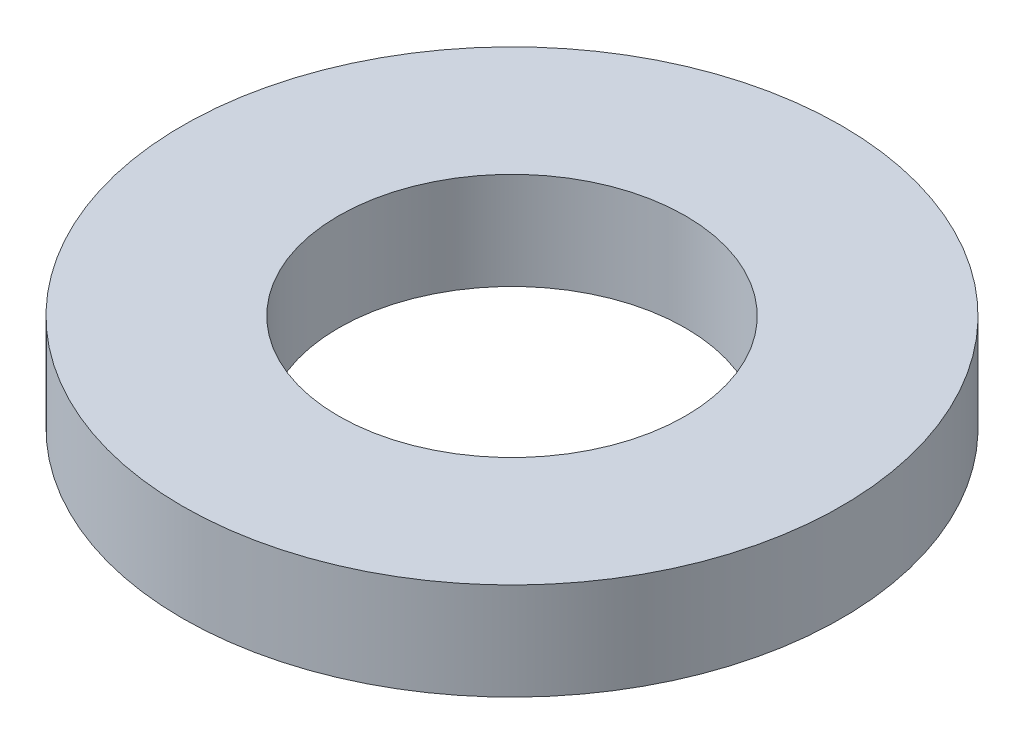
ISO-10303-21;
HEADER;
FILE_DESCRIPTION(('STEP AP214'),'2;1');
FILE_NAME('part.step','',(''),(''),'','','');
FILE_SCHEMA(('AUTOMOTIVE_DESIGN { 1 0 10303 214 1 1 1 1 }'));
ENDSEC;
DATA;
#1=APPLICATION_CONTEXT('core data for automotive mechanical design processes');
#2=APPLICATION_PROTOCOL_DEFINITION('international standard','automotive_design',2000,#1);
#3=PRODUCT_CONTEXT('',#1,'mechanical');
#4=PRODUCT('Part','Part','',(#3));
#5=PRODUCT_RELATED_PRODUCT_CATEGORY('part','',(#4));
#6=PRODUCT_DEFINITION_FORMATION('','',#4);
#7=PRODUCT_DEFINITION_CONTEXT('part definition',#1,'design');
#8=PRODUCT_DEFINITION('design','',#6,#7);
#9=PRODUCT_DEFINITION_SHAPE('','',#8);
#10=(LENGTH_UNIT() NAMED_UNIT(*) SI_UNIT(.MILLI.,.METRE.));
#11=(NAMED_UNIT(*) PLANE_ANGLE_UNIT() SI_UNIT($,.RADIAN.));
#12=(NAMED_UNIT(*) SI_UNIT($,.STERADIAN.) SOLID_ANGLE_UNIT());
#13=UNCERTAINTY_MEASURE_WITH_UNIT(LENGTH_MEASURE(1.E-05),#10,'distance_accuracy_value','');
#14=(GEOMETRIC_REPRESENTATION_CONTEXT(3) GLOBAL_UNCERTAINTY_ASSIGNED_CONTEXT((#13)) GLOBAL_UNIT_ASSIGNED_CONTEXT((#10,
#11,#12)) REPRESENTATION_CONTEXT('',''));
#15=CARTESIAN_POINT('',(0.,0.,0.));
#16=DIRECTION('',(0.,0.,1.));
#17=DIRECTION('',(1.,0.,0.));
#18=AXIS2_PLACEMENT_3D('',#15,#16,#17);
#19=CARTESIAN_POINT('',(0.,28.,0.));
#20=DIRECTION('',(0.,-1.,0.));
#21=DIRECTION('',(0.,0.,-1.));
#22=AXIS2_PLACEMENT_3D('',#19,#20,#21);
#23=CYLINDRICAL_SURFACE('',#22,95.);
#24=CARTESIAN_POINT('',(0.,28.,0.));
#25=DIRECTION('',(0.,1.,0.));
#26=DIRECTION('',(0.,0.,1.));
#27=AXIS2_PLACEMENT_3D('',#24,#25,#26);
#28=CIRCLE('',#27,95.);
#29=CARTESIAN_POINT('',(0.,28.,95.));
#30=VERTEX_POINT('',#29);
#31=EDGE_CURVE('E10',#30,#30,#28,.T.);
#32=ORIENTED_EDGE('',*,*,#31,.F.);
#33=EDGE_LOOP('',(#32));
#34=FACE_BOUND('',#33,.T.);
#35=CARTESIAN_POINT('',(0.,0.,0.));
#36=DIRECTION('',(0.,1.,0.));
#37=DIRECTION('',(0.,0.,1.));
#38=AXIS2_PLACEMENT_3D('',#35,#36,#37);
#39=CIRCLE('',#38,95.);
#40=CARTESIAN_POINT('',(0.,0.,95.));
#41=VERTEX_POINT('',#40);
#42=EDGE_CURVE('E37',#41,#41,#39,.T.);
#43=ORIENTED_EDGE('',*,*,#42,.T.);
#44=EDGE_LOOP('',(#43));
#45=FACE_BOUND('',#44,.T.);
#46=ADVANCED_FACE('F40',(#34,#45),#23,.T.);
#47=CARTESIAN_POINT('',(0.,28.,0.));
#48=DIRECTION('',(0.,1.,0.));
#49=DIRECTION('',(0.,0.,1.));
#50=AXIS2_PLACEMENT_3D('',#47,#48,#49);
#51=PLANE('',#50);
#52=CARTESIAN_POINT('',(0.,28.,0.));
#53=DIRECTION('',(0.,1.,0.));
#54=DIRECTION('',(0.,0.,1.));
#55=AXIS2_PLACEMENT_3D('',#52,#53,#54);
#56=CIRCLE('',#55,50.);
#57=CARTESIAN_POINT('',(0.,28.,50.));
#58=VERTEX_POINT('',#57);
#59=EDGE_CURVE('E50',#58,#58,#56,.T.);
#60=ORIENTED_EDGE('',*,*,#59,.F.);
#61=EDGE_LOOP('',(#60));
#62=FACE_BOUND('',#61,.T.);
#63=ORIENTED_EDGE('',*,*,#31,.T.);
#64=EDGE_LOOP('',(#63));
#65=FACE_BOUND('',#64,.T.);
#66=ADVANCED_FACE('F59',(#62,#65),#51,.T.);
#67=CARTESIAN_POINT('',(0.,0.,0.));
#68=DIRECTION('',(0.,1.,0.));
#69=DIRECTION('',(0.,0.,1.));
#70=AXIS2_PLACEMENT_3D('',#67,#68,#69);
#71=PLANE('',#70);
#72=CARTESIAN_POINT('',(0.,0.,0.));
#73=DIRECTION('',(0.,1.,0.));
#74=DIRECTION('',(0.,0.,1.));
#75=AXIS2_PLACEMENT_3D('',#72,#73,#74);
#76=CIRCLE('',#75,50.);
#77=CARTESIAN_POINT('',(0.,0.,50.));
#78=VERTEX_POINT('',#77);
#79=EDGE_CURVE('E47',#78,#78,#76,.T.);
#80=ORIENTED_EDGE('',*,*,#79,.T.);
#81=EDGE_LOOP('',(#80));
#82=FACE_BOUND('',#81,.T.);
#83=ORIENTED_EDGE('',*,*,#42,.F.);
#84=EDGE_LOOP('',(#83));
#85=FACE_BOUND('',#84,.T.);
#86=ADVANCED_FACE('F58',(#82,#85),#71,.F.);
#87=CARTESIAN_POINT('',(0.,28.,0.));
#88=DIRECTION('',(0.,-1.,0.));
#89=DIRECTION('',(0.,0.,-1.));
#90=AXIS2_PLACEMENT_3D('',#87,#88,#89);
#91=CYLINDRICAL_SURFACE('',#90,50.);
#92=ORIENTED_EDGE('',*,*,#59,.T.);
#93=EDGE_LOOP('',(#92));
#94=FACE_BOUND('',#93,.T.);
#95=ORIENTED_EDGE('',*,*,#79,.F.);
#96=EDGE_LOOP('',(#95));
#97=FACE_BOUND('',#96,.T.);
#98=ADVANCED_FACE('F54',(#94,#97),#91,.F.);
#99=CLOSED_SHELL('',(#46,#66,#86,#98));
#100=MANIFOLD_SOLID_BREP('B2',#99);
#101=ADVANCED_BREP_SHAPE_REPRESENTATION('',(#18,#100),#14);
#102=SHAPE_DEFINITION_REPRESENTATION(#9,#101);
ENDSEC;
END-ISO-10303-21;
